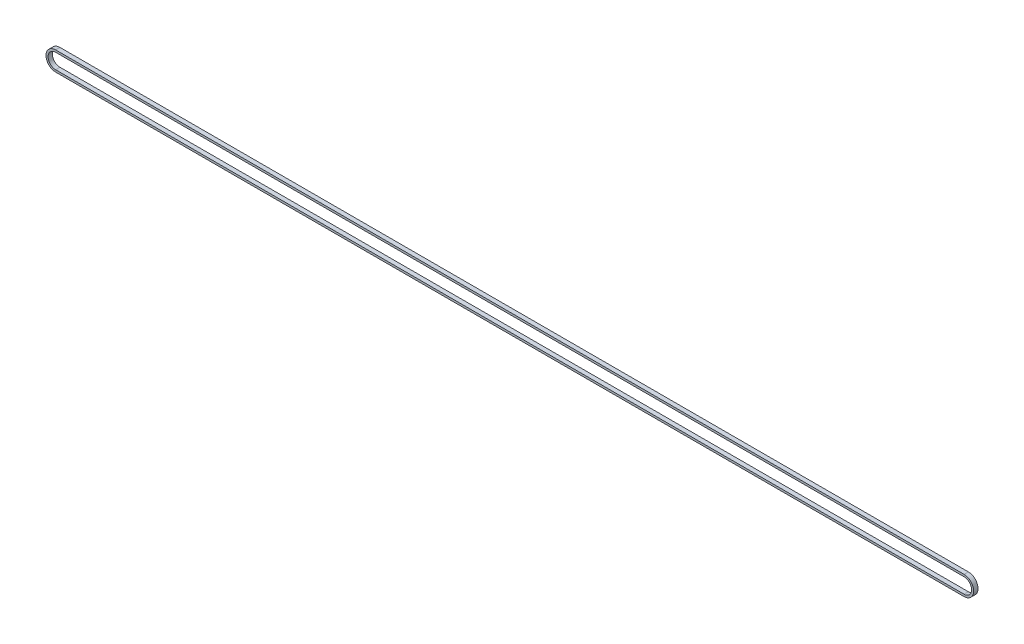
ISO-10303-21;
HEADER;
FILE_DESCRIPTION(('STEP AP214'),'2;1');
FILE_NAME('part.step','',(''),(''),'','','');
FILE_SCHEMA(('AUTOMOTIVE_DESIGN { 1 0 10303 214 1 1 1 1 }'));
ENDSEC;
DATA;
#1=APPLICATION_CONTEXT('core data for automotive mechanical design processes');
#2=APPLICATION_PROTOCOL_DEFINITION('international standard','automotive_design',2000,#1);
#3=PRODUCT_CONTEXT('',#1,'mechanical');
#4=PRODUCT('Part','Part','',(#3));
#5=PRODUCT_RELATED_PRODUCT_CATEGORY('part','',(#4));
#6=PRODUCT_DEFINITION_FORMATION('','',#4);
#7=PRODUCT_DEFINITION_CONTEXT('part definition',#1,'design');
#8=PRODUCT_DEFINITION('design','',#6,#7);
#9=PRODUCT_DEFINITION_SHAPE('','',#8);
#10=(LENGTH_UNIT() NAMED_UNIT(*) SI_UNIT(.MILLI.,.METRE.));
#11=(NAMED_UNIT(*) PLANE_ANGLE_UNIT() SI_UNIT($,.RADIAN.));
#12=(NAMED_UNIT(*) SI_UNIT($,.STERADIAN.) SOLID_ANGLE_UNIT());
#13=UNCERTAINTY_MEASURE_WITH_UNIT(LENGTH_MEASURE(1.E-05),#10,'distance_accuracy_value','');
#14=(GEOMETRIC_REPRESENTATION_CONTEXT(3) GLOBAL_UNCERTAINTY_ASSIGNED_CONTEXT((#13)) GLOBAL_UNIT_ASSIGNED_CONTEXT((#10,
#11,#12)) REPRESENTATION_CONTEXT('',''));
#15=CARTESIAN_POINT('',(0.,0.,0.));
#16=DIRECTION('',(0.,0.,1.));
#17=DIRECTION('',(1.,0.,0.));
#18=AXIS2_PLACEMENT_3D('',#15,#16,#17);
#19=CARTESIAN_POINT('',(0.,0.,2.5));
#20=DIRECTION('',(0.,0.,1.));
#21=DIRECTION('',(1.,0.,0.));
#22=AXIS2_PLACEMENT_3D('',#19,#20,#21);
#23=PLANE('',#22);
#24=CARTESIAN_POINT('',(0.,0.,2.5));
#25=DIRECTION('',(0.,0.,1.));
#26=DIRECTION('',(1.,0.,0.));
#27=AXIS2_PLACEMENT_3D('',#24,#25,#26);
#28=CIRCLE('',#27,11.15);
#29=CARTESIAN_POINT('',(0.,11.15,2.5));
#30=VERTEX_POINT('',#29);
#31=CARTESIAN_POINT('',(0.,-11.15,2.5));
#32=VERTEX_POINT('',#31);
#33=EDGE_CURVE('E164',#30,#32,#28,.T.);
#34=ORIENTED_EDGE('',*,*,#33,.T.);
#35=DIRECTION('',(1.,0.,0.));
#36=VECTOR('',#35,1.);
#37=CARTESIAN_POINT('',(1051.8,-11.15,2.5));
#38=LINE('',#37,#36);
#39=CARTESIAN_POINT('',(1051.8,-11.15,2.5));
#40=VERTEX_POINT('',#39);
#41=EDGE_CURVE('E167',#32,#40,#38,.T.);
#42=ORIENTED_EDGE('',*,*,#41,.T.);
#43=CARTESIAN_POINT('',(1051.8,0.,2.5));
#44=DIRECTION('',(0.,0.,1.));
#45=DIRECTION('',(1.,0.,0.));
#46=AXIS2_PLACEMENT_3D('',#43,#44,#45);
#47=CIRCLE('',#46,11.15);
#48=CARTESIAN_POINT('',(1051.8,11.15,2.5));
#49=VERTEX_POINT('',#48);
#50=EDGE_CURVE('E170',#40,#49,#47,.T.);
#51=ORIENTED_EDGE('',*,*,#50,.T.);
#52=DIRECTION('',(-1.,0.,0.));
#53=VECTOR('',#52,1.);
#54=CARTESIAN_POINT('',(0.,11.15,2.5));
#55=LINE('',#54,#53);
#56=EDGE_CURVE('E172',#49,#30,#55,.T.);
#57=ORIENTED_EDGE('',*,*,#56,.T.);
#58=EDGE_LOOP('',(#34,#42,#51,#57));
#59=FACE_BOUND('',#58,.T.);
#60=DIRECTION('',(1.,0.,0.));
#61=VECTOR('',#60,1.);
#62=CARTESIAN_POINT('',(1051.8,-8.75,2.5));
#63=LINE('',#62,#61);
#64=CARTESIAN_POINT('',(0.,-8.75,2.5));
#65=VERTEX_POINT('',#64);
#66=CARTESIAN_POINT('',(1051.8,-8.75,2.5));
#67=VERTEX_POINT('',#66);
#68=EDGE_CURVE('E136',#65,#67,#63,.T.);
#69=ORIENTED_EDGE('',*,*,#68,.F.);
#70=CARTESIAN_POINT('',(0.,0.,2.5));
#71=DIRECTION('',(0.,0.,1.));
#72=DIRECTION('',(1.,0.,0.));
#73=AXIS2_PLACEMENT_3D('',#70,#71,#72);
#74=CIRCLE('',#73,8.75);
#75=CARTESIAN_POINT('',(0.,8.75,2.5));
#76=VERTEX_POINT('',#75);
#77=EDGE_CURVE('E128',#76,#65,#74,.T.);
#78=ORIENTED_EDGE('',*,*,#77,.F.);
#79=DIRECTION('',(-1.,0.,0.));
#80=VECTOR('',#79,1.);
#81=CARTESIAN_POINT('',(0.,8.75,2.5));
#82=LINE('',#81,#80);
#83=CARTESIAN_POINT('',(1051.8,8.75,2.5));
#84=VERTEX_POINT('',#83);
#85=EDGE_CURVE('E150',#84,#76,#82,.T.);
#86=ORIENTED_EDGE('',*,*,#85,.F.);
#87=CARTESIAN_POINT('',(1051.8,0.,2.5));
#88=DIRECTION('',(0.,0.,1.));
#89=DIRECTION('',(1.,0.,0.));
#90=AXIS2_PLACEMENT_3D('',#87,#88,#89);
#91=CIRCLE('',#90,8.75);
#92=EDGE_CURVE('E148',#67,#84,#91,.T.);
#93=ORIENTED_EDGE('',*,*,#92,.F.);
#94=EDGE_LOOP('',(#69,#78,#86,#93));
#95=FACE_BOUND('',#94,.T.);
#96=ADVANCED_FACE('F63',(#59,#95),#23,.T.);
#97=CARTESIAN_POINT('',(0.,0.,-2.5));
#98=DIRECTION('',(0.,0.,1.));
#99=DIRECTION('',(1.,0.,0.));
#100=AXIS2_PLACEMENT_3D('',#97,#98,#99);
#101=PLANE('',#100);
#102=CARTESIAN_POINT('',(0.,0.,-2.5));
#103=DIRECTION('',(0.,0.,1.));
#104=DIRECTION('',(1.,0.,0.));
#105=AXIS2_PLACEMENT_3D('',#102,#103,#104);
#106=CIRCLE('',#105,11.15);
#107=CARTESIAN_POINT('',(0.,11.15,-2.5));
#108=VERTEX_POINT('',#107);
#109=CARTESIAN_POINT('',(0.,-11.15,-2.5));
#110=VERTEX_POINT('',#109);
#111=EDGE_CURVE('E144',#108,#110,#106,.T.);
#112=ORIENTED_EDGE('',*,*,#111,.F.);
#113=DIRECTION('',(-1.,0.,0.));
#114=VECTOR('',#113,1.);
#115=CARTESIAN_POINT('',(0.,11.15,-2.5));
#116=LINE('',#115,#114);
#117=CARTESIAN_POINT('',(1051.8,11.15,-2.5));
#118=VERTEX_POINT('',#117);
#119=EDGE_CURVE('E168',#118,#108,#116,.T.);
#120=ORIENTED_EDGE('',*,*,#119,.F.);
#121=CARTESIAN_POINT('',(1051.8,0.,-2.5));
#122=DIRECTION('',(0.,0.,1.));
#123=DIRECTION('',(1.,0.,0.));
#124=AXIS2_PLACEMENT_3D('',#121,#122,#123);
#125=CIRCLE('',#124,11.15);
#126=CARTESIAN_POINT('',(1051.8,-11.15,-2.5));
#127=VERTEX_POINT('',#126);
#128=EDGE_CURVE('E179',#127,#118,#125,.T.);
#129=ORIENTED_EDGE('',*,*,#128,.F.);
#130=DIRECTION('',(1.,0.,0.));
#131=VECTOR('',#130,1.);
#132=CARTESIAN_POINT('',(1051.8,-11.15,-2.5));
#133=LINE('',#132,#131);
#134=EDGE_CURVE('E177',#110,#127,#133,.T.);
#135=ORIENTED_EDGE('',*,*,#134,.F.);
#136=EDGE_LOOP('',(#112,#120,#129,#135));
#137=FACE_BOUND('',#136,.T.);
#138=CARTESIAN_POINT('',(0.,0.,-2.5));
#139=DIRECTION('',(0.,0.,1.));
#140=DIRECTION('',(1.,0.,0.));
#141=AXIS2_PLACEMENT_3D('',#138,#139,#140);
#142=CIRCLE('',#141,8.75);
#143=CARTESIAN_POINT('',(0.,8.75,-2.5));
#144=VERTEX_POINT('',#143);
#145=CARTESIAN_POINT('',(0.,-8.75,-2.5));
#146=VERTEX_POINT('',#145);
#147=EDGE_CURVE('E86',#144,#146,#142,.T.);
#148=ORIENTED_EDGE('',*,*,#147,.T.);
#149=DIRECTION('',(1.,0.,0.));
#150=VECTOR('',#149,1.);
#151=CARTESIAN_POINT('',(1051.8,-8.75,-2.5));
#152=LINE('',#151,#150);
#153=CARTESIAN_POINT('',(1051.8,-8.75,-2.5));
#154=VERTEX_POINT('',#153);
#155=EDGE_CURVE('E143',#146,#154,#152,.T.);
#156=ORIENTED_EDGE('',*,*,#155,.T.);
#157=CARTESIAN_POINT('',(1051.8,0.,-2.5));
#158=DIRECTION('',(0.,0.,1.));
#159=DIRECTION('',(1.,0.,0.));
#160=AXIS2_PLACEMENT_3D('',#157,#158,#159);
#161=CIRCLE('',#160,8.75);
#162=CARTESIAN_POINT('',(1051.8,8.75,-2.5));
#163=VERTEX_POINT('',#162);
#164=EDGE_CURVE('E156',#154,#163,#161,.T.);
#165=ORIENTED_EDGE('',*,*,#164,.T.);
#166=DIRECTION('',(-1.,0.,0.));
#167=VECTOR('',#166,1.);
#168=CARTESIAN_POINT('',(0.,8.75,-2.5));
#169=LINE('',#168,#167);
#170=EDGE_CURVE('E137',#163,#144,#169,.T.);
#171=ORIENTED_EDGE('',*,*,#170,.T.);
#172=EDGE_LOOP('',(#148,#156,#165,#171));
#173=FACE_BOUND('',#172,.T.);
#174=ADVANCED_FACE('F197',(#137,#173),#101,.F.);
#175=CARTESIAN_POINT('',(0.,0.,2.5));
#176=DIRECTION('',(0.,0.,-1.));
#177=DIRECTION('',(-1.,0.,0.));
#178=AXIS2_PLACEMENT_3D('',#175,#176,#177);
#179=CYLINDRICAL_SURFACE('',#178,11.15);
#180=ORIENTED_EDGE('',*,*,#111,.T.);
#181=DIRECTION('',(0.,0.,-1.));
#182=VECTOR('',#181,1.);
#183=CARTESIAN_POINT('',(0.,-11.15,2.5));
#184=LINE('',#183,#182);
#185=EDGE_CURVE('E12',#32,#110,#184,.T.);
#186=ORIENTED_EDGE('',*,*,#185,.F.);
#187=ORIENTED_EDGE('',*,*,#33,.F.);
#188=DIRECTION('',(0.,0.,-1.));
#189=VECTOR('',#188,1.);
#190=CARTESIAN_POINT('',(0.,11.15,2.5));
#191=LINE('',#190,#189);
#192=EDGE_CURVE('E174',#30,#108,#191,.T.);
#193=ORIENTED_EDGE('',*,*,#192,.T.);
#194=EDGE_LOOP('',(#180,#186,#187,#193));
#195=FACE_BOUND('',#194,.T.);
#196=ADVANCED_FACE('F65',(#195),#179,.T.);
#197=CARTESIAN_POINT('',(1051.8,-11.15,2.5));
#198=DIRECTION('',(0.,1.,0.));
#199=DIRECTION('',(0.,0.,1.));
#200=AXIS2_PLACEMENT_3D('',#197,#198,#199);
#201=PLANE('',#200);
#202=ORIENTED_EDGE('',*,*,#134,.T.);
#203=DIRECTION('',(0.,0.,-1.));
#204=VECTOR('',#203,1.);
#205=CARTESIAN_POINT('',(1051.8,-11.15,2.5));
#206=LINE('',#205,#204);
#207=EDGE_CURVE('E71',#40,#127,#206,.T.);
#208=ORIENTED_EDGE('',*,*,#207,.F.);
#209=ORIENTED_EDGE('',*,*,#41,.F.);
#210=ORIENTED_EDGE('',*,*,#185,.T.);
#211=EDGE_LOOP('',(#202,#208,#209,#210));
#212=FACE_BOUND('',#211,.T.);
#213=ADVANCED_FACE('F207',(#212),#201,.F.);
#214=CARTESIAN_POINT('',(1051.8,0.,2.5));
#215=DIRECTION('',(0.,0.,-1.));
#216=DIRECTION('',(-1.,0.,0.));
#217=AXIS2_PLACEMENT_3D('',#214,#215,#216);
#218=CYLINDRICAL_SURFACE('',#217,11.15);
#219=ORIENTED_EDGE('',*,*,#128,.T.);
#220=DIRECTION('',(0.,0.,-1.));
#221=VECTOR('',#220,1.);
#222=CARTESIAN_POINT('',(1051.8,11.15,2.5));
#223=LINE('',#222,#221);
#224=EDGE_CURVE('E184',#49,#118,#223,.T.);
#225=ORIENTED_EDGE('',*,*,#224,.F.);
#226=ORIENTED_EDGE('',*,*,#50,.F.);
#227=ORIENTED_EDGE('',*,*,#207,.T.);
#228=EDGE_LOOP('',(#219,#225,#226,#227));
#229=FACE_BOUND('',#228,.T.);
#230=ADVANCED_FACE('F191',(#229),#218,.T.);
#231=CARTESIAN_POINT('',(0.,11.15,2.5));
#232=DIRECTION('',(0.,-1.,0.));
#233=DIRECTION('',(0.,0.,-1.));
#234=AXIS2_PLACEMENT_3D('',#231,#232,#233);
#235=PLANE('',#234);
#236=ORIENTED_EDGE('',*,*,#119,.T.);
#237=ORIENTED_EDGE('',*,*,#192,.F.);
#238=ORIENTED_EDGE('',*,*,#56,.F.);
#239=ORIENTED_EDGE('',*,*,#224,.T.);
#240=EDGE_LOOP('',(#236,#237,#238,#239));
#241=FACE_BOUND('',#240,.T.);
#242=ADVANCED_FACE('F201',(#241),#235,.F.);
#243=CARTESIAN_POINT('',(0.,0.,2.5));
#244=DIRECTION('',(0.,0.,-1.));
#245=DIRECTION('',(-1.,0.,0.));
#246=AXIS2_PLACEMENT_3D('',#243,#244,#245);
#247=CYLINDRICAL_SURFACE('',#246,8.75);
#248=ORIENTED_EDGE('',*,*,#147,.F.);
#249=DIRECTION('',(0.,0.,-1.));
#250=VECTOR('',#249,1.);
#251=CARTESIAN_POINT('',(0.,8.75,2.5));
#252=LINE('',#251,#250);
#253=EDGE_CURVE('E132',#76,#144,#252,.T.);
#254=ORIENTED_EDGE('',*,*,#253,.F.);
#255=ORIENTED_EDGE('',*,*,#77,.T.);
#256=DIRECTION('',(0.,0.,-1.));
#257=VECTOR('',#256,1.);
#258=CARTESIAN_POINT('',(0.,-8.75,2.5));
#259=LINE('',#258,#257);
#260=EDGE_CURVE('E131',#65,#146,#259,.T.);
#261=ORIENTED_EDGE('',*,*,#260,.T.);
#262=EDGE_LOOP('',(#248,#254,#255,#261));
#263=FACE_BOUND('',#262,.T.);
#264=ADVANCED_FACE('F130',(#263),#247,.F.);
#265=CARTESIAN_POINT('',(1051.8,-8.75,2.5));
#266=DIRECTION('',(0.,1.,0.));
#267=DIRECTION('',(0.,0.,1.));
#268=AXIS2_PLACEMENT_3D('',#265,#266,#267);
#269=PLANE('',#268);
#270=ORIENTED_EDGE('',*,*,#155,.F.);
#271=ORIENTED_EDGE('',*,*,#260,.F.);
#272=ORIENTED_EDGE('',*,*,#68,.T.);
#273=DIRECTION('',(0.,0.,-1.));
#274=VECTOR('',#273,1.);
#275=CARTESIAN_POINT('',(1051.8,-8.75,2.5));
#276=LINE('',#275,#274);
#277=EDGE_CURVE('E145',#67,#154,#276,.T.);
#278=ORIENTED_EDGE('',*,*,#277,.T.);
#279=EDGE_LOOP('',(#270,#271,#272,#278));
#280=FACE_BOUND('',#279,.T.);
#281=ADVANCED_FACE('F140',(#280),#269,.T.);
#282=CARTESIAN_POINT('',(1051.8,0.,2.5));
#283=DIRECTION('',(0.,0.,-1.));
#284=DIRECTION('',(-1.,0.,0.));
#285=AXIS2_PLACEMENT_3D('',#282,#283,#284);
#286=CYLINDRICAL_SURFACE('',#285,8.75);
#287=ORIENTED_EDGE('',*,*,#164,.F.);
#288=ORIENTED_EDGE('',*,*,#277,.F.);
#289=ORIENTED_EDGE('',*,*,#92,.T.);
#290=DIRECTION('',(0.,0.,-1.));
#291=VECTOR('',#290,1.);
#292=CARTESIAN_POINT('',(1051.8,8.75,2.5));
#293=LINE('',#292,#291);
#294=EDGE_CURVE('E78',#84,#163,#293,.T.);
#295=ORIENTED_EDGE('',*,*,#294,.T.);
#296=EDGE_LOOP('',(#287,#288,#289,#295));
#297=FACE_BOUND('',#296,.T.);
#298=ADVANCED_FACE('F230',(#297),#286,.F.);
#299=CARTESIAN_POINT('',(0.,8.75,2.5));
#300=DIRECTION('',(0.,-1.,0.));
#301=DIRECTION('',(0.,0.,-1.));
#302=AXIS2_PLACEMENT_3D('',#299,#300,#301);
#303=PLANE('',#302);
#304=ORIENTED_EDGE('',*,*,#170,.F.);
#305=ORIENTED_EDGE('',*,*,#294,.F.);
#306=ORIENTED_EDGE('',*,*,#85,.T.);
#307=ORIENTED_EDGE('',*,*,#253,.T.);
#308=EDGE_LOOP('',(#304,#305,#306,#307));
#309=FACE_BOUND('',#308,.T.);
#310=ADVANCED_FACE('F234',(#309),#303,.T.);
#311=CLOSED_SHELL('',(#96,#174,#196,#213,#230,#242,#264,#281,#298,#310));
#312=MANIFOLD_SOLID_BREP('B2',#311);
#313=ADVANCED_BREP_SHAPE_REPRESENTATION('',(#18,#312),#14);
#314=SHAPE_DEFINITION_REPRESENTATION(#9,#313);
ENDSEC;
END-ISO-10303-21;
